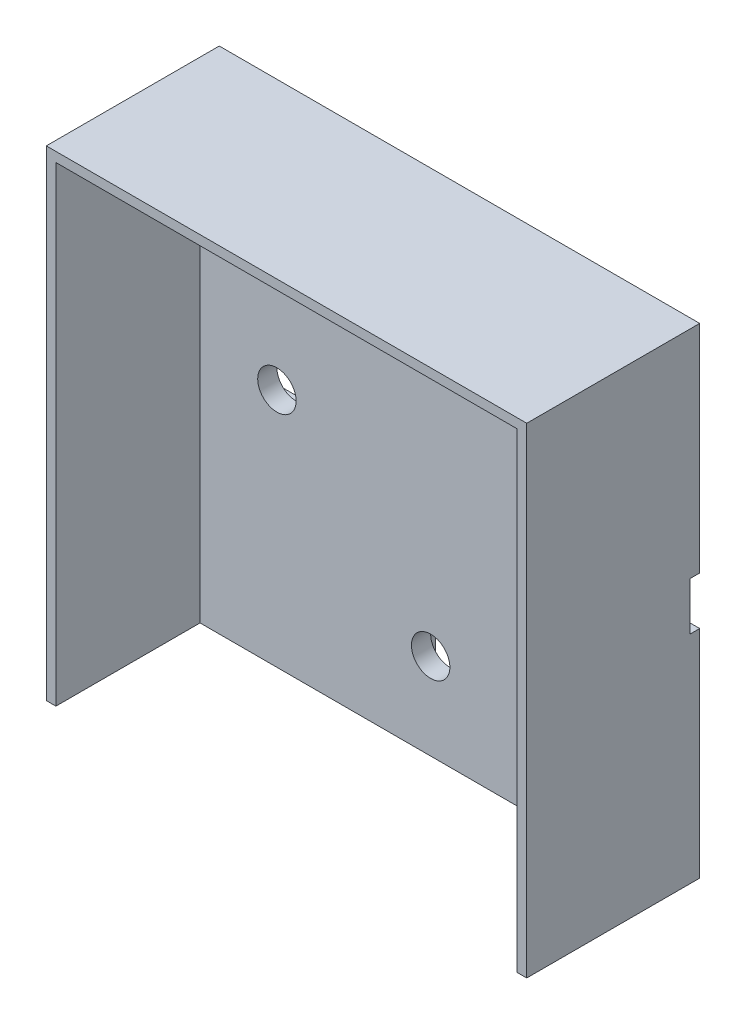
ISO-10303-21;
HEADER;
FILE_DESCRIPTION(('STEP AP214'),'2;1');
FILE_NAME('part.step','',(''),(''),'','','');
FILE_SCHEMA(('AUTOMOTIVE_DESIGN { 1 0 10303 214 1 1 1 1 }'));
ENDSEC;
DATA;
#1=APPLICATION_CONTEXT('core data for automotive mechanical design processes');
#2=APPLICATION_PROTOCOL_DEFINITION('international standard','automotive_design',2000,#1);
#3=PRODUCT_CONTEXT('',#1,'mechanical');
#4=PRODUCT('Part','Part','',(#3));
#5=PRODUCT_RELATED_PRODUCT_CATEGORY('part','',(#4));
#6=PRODUCT_DEFINITION_FORMATION('','',#4);
#7=PRODUCT_DEFINITION_CONTEXT('part definition',#1,'design');
#8=PRODUCT_DEFINITION('design','',#6,#7);
#9=PRODUCT_DEFINITION_SHAPE('','',#8);
#10=(LENGTH_UNIT() NAMED_UNIT(*) SI_UNIT(.MILLI.,.METRE.));
#11=(NAMED_UNIT(*) PLANE_ANGLE_UNIT() SI_UNIT($,.RADIAN.));
#12=(NAMED_UNIT(*) SI_UNIT($,.STERADIAN.) SOLID_ANGLE_UNIT());
#13=UNCERTAINTY_MEASURE_WITH_UNIT(LENGTH_MEASURE(1.E-05),#10,'distance_accuracy_value','');
#14=(GEOMETRIC_REPRESENTATION_CONTEXT(3) GLOBAL_UNCERTAINTY_ASSIGNED_CONTEXT((#13)) GLOBAL_UNIT_ASSIGNED_CONTEXT((#10,
#11,#12)) REPRESENTATION_CONTEXT('',''));
#15=CARTESIAN_POINT('',(0.,0.,0.));
#16=DIRECTION('',(0.,0.,1.));
#17=DIRECTION('',(1.,0.,0.));
#18=AXIS2_PLACEMENT_3D('',#15,#16,#17);
#19=CARTESIAN_POINT('',(0.,0.,3.));
#20=DIRECTION('',(0.,0.,1.));
#21=DIRECTION('',(1.,0.,0.));
#22=AXIS2_PLACEMENT_3D('',#19,#20,#21);
#23=PLANE('',#22);
#24=CARTESIAN_POINT('',(16.,0.,3.));
#25=DIRECTION('',(0.,0.,1.));
#26=DIRECTION('',(1.,0.,0.));
#27=AXIS2_PLACEMENT_3D('',#24,#25,#26);
#28=CIRCLE('',#27,2.);
#29=CARTESIAN_POINT('',(18.,0.,3.));
#30=VERTEX_POINT('',#29);
#31=EDGE_CURVE('E274',#30,#30,#28,.T.);
#32=ORIENTED_EDGE('',*,*,#31,.F.);
#33=EDGE_LOOP('',(#32));
#34=FACE_BOUND('',#33,.T.);
#35=CARTESIAN_POINT('',(-16.,0.,3.));
#36=DIRECTION('',(0.,0.,1.));
#37=DIRECTION('',(1.,0.,0.));
#38=AXIS2_PLACEMENT_3D('',#35,#36,#37);
#39=CIRCLE('',#38,2.);
#40=CARTESIAN_POINT('',(-14.,0.,3.));
#41=VERTEX_POINT('',#40);
#42=EDGE_CURVE('E343',#41,#41,#39,.T.);
#43=ORIENTED_EDGE('',*,*,#42,.F.);
#44=EDGE_LOOP('',(#43));
#45=FACE_BOUND('',#44,.T.);
#46=CARTESIAN_POINT('',(0.,-16.,3.));
#47=DIRECTION('',(0.,0.,1.));
#48=DIRECTION('',(1.,0.,0.));
#49=AXIS2_PLACEMENT_3D('',#46,#47,#48);
#50=CIRCLE('',#49,2.);
#51=CARTESIAN_POINT('',(2.,-16.,3.));
#52=VERTEX_POINT('',#51);
#53=EDGE_CURVE('E346',#52,#52,#50,.T.);
#54=ORIENTED_EDGE('',*,*,#53,.F.);
#55=EDGE_LOOP('',(#54));
#56=FACE_BOUND('',#55,.T.);
#57=DIRECTION('',(1.,0.,0.));
#58=VECTOR('',#57,1.);
#59=CARTESIAN_POINT('',(0.,24.,3.));
#60=LINE('',#59,#58);
#61=CARTESIAN_POINT('',(-24.,24.,3.));
#62=VERTEX_POINT('',#61);
#63=CARTESIAN_POINT('',(24.,24.,3.));
#64=VERTEX_POINT('',#63);
#65=EDGE_CURVE('E52',#62,#64,#60,.T.);
#66=ORIENTED_EDGE('',*,*,#65,.F.);
#67=DIRECTION('',(0.,-1.,0.));
#68=VECTOR('',#67,1.);
#69=CARTESIAN_POINT('',(-24.,0.,3.));
#70=LINE('',#69,#68);
#71=CARTESIAN_POINT('',(-24.,-25.,3.));
#72=VERTEX_POINT('',#71);
#73=EDGE_CURVE('E167',#62,#72,#70,.T.);
#74=ORIENTED_EDGE('',*,*,#73,.T.);
#75=DIRECTION('',(-1.,0.,0.));
#76=VECTOR('',#75,1.);
#77=CARTESIAN_POINT('',(25.,-25.,3.));
#78=LINE('',#77,#76);
#79=CARTESIAN_POINT('',(24.,-25.,3.));
#80=VERTEX_POINT('',#79);
#81=EDGE_CURVE('E227',#80,#72,#78,.T.);
#82=ORIENTED_EDGE('',*,*,#81,.F.);
#83=DIRECTION('',(0.,-1.,0.));
#84=VECTOR('',#83,1.);
#85=CARTESIAN_POINT('',(24.,0.,3.));
#86=LINE('',#85,#84);
#87=EDGE_CURVE('E57',#64,#80,#86,.T.);
#88=ORIENTED_EDGE('',*,*,#87,.F.);
#89=EDGE_LOOP('',(#66,#74,#82,#88));
#90=FACE_BOUND('',#89,.T.);
#91=ADVANCED_FACE('F35',(#34,#45,#56,#90),#23,.T.);
#92=CARTESIAN_POINT('',(25.,25.,3.));
#93=DIRECTION('',(1.,0.,0.));
#94=DIRECTION('',(0.,1.,0.));
#95=AXIS2_PLACEMENT_3D('',#92,#93,#94);
#96=PLANE('',#95);
#97=DIRECTION('',(0.,-1.,0.));
#98=VECTOR('',#97,1.);
#99=CARTESIAN_POINT('',(25.,2.5,1.));
#100=LINE('',#99,#98);
#101=CARTESIAN_POINT('',(25.,2.5,1.));
#102=VERTEX_POINT('',#101);
#103=CARTESIAN_POINT('',(25.,-2.5,1.));
#104=VERTEX_POINT('',#103);
#105=EDGE_CURVE('E179',#102,#104,#100,.T.);
#106=ORIENTED_EDGE('',*,*,#105,.F.);
#107=DIRECTION('',(0.,0.,-1.));
#108=VECTOR('',#107,1.);
#109=CARTESIAN_POINT('',(25.,2.5,1.));
#110=LINE('',#109,#108);
#111=CARTESIAN_POINT('',(25.,2.5,0.));
#112=VERTEX_POINT('',#111);
#113=EDGE_CURVE('E199',#102,#112,#110,.T.);
#114=ORIENTED_EDGE('',*,*,#113,.T.);
#115=DIRECTION('',(0.,-1.,0.));
#116=VECTOR('',#115,1.);
#117=CARTESIAN_POINT('',(25.,25.,0.));
#118=LINE('',#117,#116);
#119=CARTESIAN_POINT('',(25.,25.,0.));
#120=VERTEX_POINT('',#119);
#121=EDGE_CURVE('E230',#120,#112,#118,.T.);
#122=ORIENTED_EDGE('',*,*,#121,.F.);
#123=DIRECTION('',(0.,0.,-1.));
#124=VECTOR('',#123,1.);
#125=CARTESIAN_POINT('',(25.,25.,3.));
#126=LINE('',#125,#124);
#127=CARTESIAN_POINT('',(25.,25.,18.));
#128=VERTEX_POINT('',#127);
#129=EDGE_CURVE('E44',#128,#120,#126,.T.);
#130=ORIENTED_EDGE('',*,*,#129,.F.);
#131=DIRECTION('',(0.,1.,0.));
#132=VECTOR('',#131,1.);
#133=CARTESIAN_POINT('',(25.,0.,18.));
#134=LINE('',#133,#132);
#135=CARTESIAN_POINT('',(25.,-25.,18.));
#136=VERTEX_POINT('',#135);
#137=EDGE_CURVE('E267',#136,#128,#134,.T.);
#138=ORIENTED_EDGE('',*,*,#137,.F.);
#139=DIRECTION('',(0.,0.,-1.));
#140=VECTOR('',#139,1.);
#141=CARTESIAN_POINT('',(25.,-25.,3.));
#142=LINE('',#141,#140);
#143=CARTESIAN_POINT('',(25.,-25.,0.));
#144=VERTEX_POINT('',#143);
#145=EDGE_CURVE('E11',#136,#144,#142,.T.);
#146=ORIENTED_EDGE('',*,*,#145,.T.);
#147=CARTESIAN_POINT('',(25.,-2.5,0.));
#148=VERTEX_POINT('',#147);
#149=EDGE_CURVE('E240',#148,#144,#118,.T.);
#150=ORIENTED_EDGE('',*,*,#149,.F.);
#151=DIRECTION('',(0.,0.,-1.));
#152=VECTOR('',#151,1.);
#153=CARTESIAN_POINT('',(25.,-2.5,1.));
#154=LINE('',#153,#152);
#155=EDGE_CURVE('E192',#104,#148,#154,.T.);
#156=ORIENTED_EDGE('',*,*,#155,.F.);
#157=EDGE_LOOP('',(#106,#114,#122,#130,#138,#146,#150,#156));
#158=FACE_BOUND('',#157,.T.);
#159=ADVANCED_FACE('F282',(#158),#96,.T.);
#160=CARTESIAN_POINT('',(-25.,25.,3.));
#161=DIRECTION('',(1.,0.,0.));
#162=DIRECTION('',(0.,1.,0.));
#163=AXIS2_PLACEMENT_3D('',#160,#161,#162);
#164=PLANE('',#163);
#165=DIRECTION('',(0.,0.,-1.));
#166=VECTOR('',#165,1.);
#167=CARTESIAN_POINT('',(-25.,2.5,1.));
#168=LINE('',#167,#166);
#169=CARTESIAN_POINT('',(-25.,2.5,1.));
#170=VERTEX_POINT('',#169);
#171=CARTESIAN_POINT('',(-25.,2.5,0.));
#172=VERTEX_POINT('',#171);
#173=EDGE_CURVE('E203',#170,#172,#168,.T.);
#174=ORIENTED_EDGE('',*,*,#173,.F.);
#175=DIRECTION('',(0.,-1.,0.));
#176=VECTOR('',#175,1.);
#177=CARTESIAN_POINT('',(-25.,2.5,1.));
#178=LINE('',#177,#176);
#179=CARTESIAN_POINT('',(-25.,-2.5,1.));
#180=VERTEX_POINT('',#179);
#181=EDGE_CURVE('E187',#170,#180,#178,.T.);
#182=ORIENTED_EDGE('',*,*,#181,.T.);
#183=DIRECTION('',(0.,0.,-1.));
#184=VECTOR('',#183,1.);
#185=CARTESIAN_POINT('',(-25.,-2.5,1.));
#186=LINE('',#185,#184);
#187=CARTESIAN_POINT('',(-25.,-2.5,0.));
#188=VERTEX_POINT('',#187);
#189=EDGE_CURVE('E205',#180,#188,#186,.T.);
#190=ORIENTED_EDGE('',*,*,#189,.T.);
#191=DIRECTION('',(0.,-1.,0.));
#192=VECTOR('',#191,1.);
#193=CARTESIAN_POINT('',(-25.,25.,0.));
#194=LINE('',#193,#192);
#195=CARTESIAN_POINT('',(-25.,-25.,0.));
#196=VERTEX_POINT('',#195);
#197=EDGE_CURVE('E234',#188,#196,#194,.T.);
#198=ORIENTED_EDGE('',*,*,#197,.T.);
#199=DIRECTION('',(0.,0.,-1.));
#200=VECTOR('',#199,1.);
#201=CARTESIAN_POINT('',(-25.,-25.,3.));
#202=LINE('',#201,#200);
#203=CARTESIAN_POINT('',(-25.,-25.,18.));
#204=VERTEX_POINT('',#203);
#205=EDGE_CURVE('E39',#204,#196,#202,.T.);
#206=ORIENTED_EDGE('',*,*,#205,.F.);
#207=DIRECTION('',(0.,-1.,0.));
#208=VECTOR('',#207,1.);
#209=CARTESIAN_POINT('',(-25.,0.,18.));
#210=LINE('',#209,#208);
#211=CARTESIAN_POINT('',(-25.,25.,18.));
#212=VERTEX_POINT('',#211);
#213=EDGE_CURVE('E259',#212,#204,#210,.T.);
#214=ORIENTED_EDGE('',*,*,#213,.F.);
#215=DIRECTION('',(0.,0.,-1.));
#216=VECTOR('',#215,1.);
#217=CARTESIAN_POINT('',(-25.,25.,3.));
#218=LINE('',#217,#216);
#219=CARTESIAN_POINT('',(-25.,25.,0.));
#220=VERTEX_POINT('',#219);
#221=EDGE_CURVE('E243',#212,#220,#218,.T.);
#222=ORIENTED_EDGE('',*,*,#221,.T.);
#223=EDGE_CURVE('E235',#220,#172,#194,.T.);
#224=ORIENTED_EDGE('',*,*,#223,.T.);
#225=EDGE_LOOP('',(#174,#182,#190,#198,#206,#214,#222,#224));
#226=FACE_BOUND('',#225,.T.);
#227=ADVANCED_FACE('F258',(#226),#164,.F.);
#228=CARTESIAN_POINT('',(0.,0.,0.));
#229=DIRECTION('',(0.,0.,1.));
#230=DIRECTION('',(1.,0.,0.));
#231=AXIS2_PLACEMENT_3D('',#228,#229,#230);
#232=PLANE('',#231);
#233=DIRECTION('',(-1.,0.,0.));
#234=VECTOR('',#233,1.);
#235=CARTESIAN_POINT('',(25.,2.5,0.));
#236=LINE('',#235,#234);
#237=EDGE_CURVE('E183',#112,#172,#236,.T.);
#238=ORIENTED_EDGE('',*,*,#237,.T.);
#239=ORIENTED_EDGE('',*,*,#223,.F.);
#240=DIRECTION('',(-1.,0.,0.));
#241=VECTOR('',#240,1.);
#242=CARTESIAN_POINT('',(25.,25.,0.));
#243=LINE('',#242,#241);
#244=EDGE_CURVE('E238',#120,#220,#243,.T.);
#245=ORIENTED_EDGE('',*,*,#244,.F.);
#246=ORIENTED_EDGE('',*,*,#121,.T.);
#247=EDGE_LOOP('',(#238,#239,#245,#246));
#248=FACE_BOUND('',#247,.T.);
#249=ADVANCED_FACE('F301',(#248),#232,.F.);
#250=DIRECTION('',(0.,-1.,0.));
#251=VECTOR('',#250,1.);
#252=CARTESIAN_POINT('',(2.5,-2.5,0.));
#253=LINE('',#252,#251);
#254=CARTESIAN_POINT('',(2.5,-2.5,0.));
#255=VERTEX_POINT('',#254);
#256=CARTESIAN_POINT('',(2.5,-25.,0.));
#257=VERTEX_POINT('',#256);
#258=EDGE_CURVE('E173',#255,#257,#253,.T.);
#259=ORIENTED_EDGE('',*,*,#258,.F.);
#260=DIRECTION('',(-1.,0.,0.));
#261=VECTOR('',#260,1.);
#262=CARTESIAN_POINT('',(25.,-2.5,0.));
#263=LINE('',#262,#261);
#264=EDGE_CURVE('E193',#148,#255,#263,.T.);
#265=ORIENTED_EDGE('',*,*,#264,.F.);
#266=ORIENTED_EDGE('',*,*,#149,.T.);
#267=DIRECTION('',(-1.,0.,0.));
#268=VECTOR('',#267,1.);
#269=CARTESIAN_POINT('',(25.,-25.,0.));
#270=LINE('',#269,#268);
#271=EDGE_CURVE('E231',#144,#257,#270,.T.);
#272=ORIENTED_EDGE('',*,*,#271,.T.);
#273=EDGE_LOOP('',(#259,#265,#266,#272));
#274=FACE_BOUND('',#273,.T.);
#275=ADVANCED_FACE('F302',(#274),#232,.F.);
#276=CARTESIAN_POINT('',(25.,-25.,3.));
#277=DIRECTION('',(0.,-1.,0.));
#278=DIRECTION('',(1.,0.,0.));
#279=AXIS2_PLACEMENT_3D('',#276,#277,#278);
#280=PLANE('',#279);
#281=DIRECTION('',(0.,0.,-1.));
#282=VECTOR('',#281,1.);
#283=CARTESIAN_POINT('',(2.5,-25.,1.));
#284=LINE('',#283,#282);
#285=CARTESIAN_POINT('',(2.5,-25.,1.));
#286=VERTEX_POINT('',#285);
#287=EDGE_CURVE('E219',#286,#257,#284,.T.);
#288=ORIENTED_EDGE('',*,*,#287,.T.);
#289=ORIENTED_EDGE('',*,*,#271,.F.);
#290=ORIENTED_EDGE('',*,*,#145,.F.);
#291=DIRECTION('',(1.,0.,0.));
#292=VECTOR('',#291,1.);
#293=CARTESIAN_POINT('',(0.,-25.,18.));
#294=LINE('',#293,#292);
#295=CARTESIAN_POINT('',(24.,-25.,18.));
#296=VERTEX_POINT('',#295);
#297=EDGE_CURVE('E158',#296,#136,#294,.T.);
#298=ORIENTED_EDGE('',*,*,#297,.F.);
#299=DIRECTION('',(0.,0.,-1.));
#300=VECTOR('',#299,1.);
#301=CARTESIAN_POINT('',(24.,-25.,18.));
#302=LINE('',#301,#300);
#303=EDGE_CURVE('E154',#296,#80,#302,.T.);
#304=ORIENTED_EDGE('',*,*,#303,.T.);
#305=ORIENTED_EDGE('',*,*,#81,.T.);
#306=DIRECTION('',(0.,0.,-1.));
#307=VECTOR('',#306,1.);
#308=CARTESIAN_POINT('',(-24.,-25.,18.));
#309=LINE('',#308,#307);
#310=CARTESIAN_POINT('',(-24.,-25.,18.));
#311=VERTEX_POINT('',#310);
#312=EDGE_CURVE('E175',#311,#72,#309,.T.);
#313=ORIENTED_EDGE('',*,*,#312,.F.);
#314=EDGE_CURVE('E255',#204,#311,#294,.T.);
#315=ORIENTED_EDGE('',*,*,#314,.F.);
#316=ORIENTED_EDGE('',*,*,#205,.T.);
#317=CARTESIAN_POINT('',(-2.5,-25.,0.));
#318=VERTEX_POINT('',#317);
#319=EDGE_CURVE('E225',#318,#196,#270,.T.);
#320=ORIENTED_EDGE('',*,*,#319,.F.);
#321=DIRECTION('',(0.,0.,-1.));
#322=VECTOR('',#321,1.);
#323=CARTESIAN_POINT('',(-2.5,-25.,1.));
#324=LINE('',#323,#322);
#325=CARTESIAN_POINT('',(-2.5,-25.,1.));
#326=VERTEX_POINT('',#325);
#327=EDGE_CURVE('E216',#326,#318,#324,.T.);
#328=ORIENTED_EDGE('',*,*,#327,.F.);
#329=DIRECTION('',(-1.,0.,0.));
#330=VECTOR('',#329,1.);
#331=CARTESIAN_POINT('',(2.5,-25.,1.));
#332=LINE('',#331,#330);
#333=EDGE_CURVE('E209',#286,#326,#332,.T.);
#334=ORIENTED_EDGE('',*,*,#333,.F.);
#335=EDGE_LOOP('',(#288,#289,#290,#298,#304,#305,#313,#315,#316,#320,#328,#334));
#336=FACE_BOUND('',#335,.T.);
#337=ADVANCED_FACE('F37',(#336),#280,.T.);
#338=CARTESIAN_POINT('',(25.,25.,3.));
#339=DIRECTION('',(0.,-1.,0.));
#340=DIRECTION('',(1.,0.,0.));
#341=AXIS2_PLACEMENT_3D('',#338,#339,#340);
#342=PLANE('',#341);
#343=ORIENTED_EDGE('',*,*,#244,.T.);
#344=ORIENTED_EDGE('',*,*,#221,.F.);
#345=DIRECTION('',(-1.,0.,0.));
#346=VECTOR('',#345,1.);
#347=CARTESIAN_POINT('',(0.,25.,18.));
#348=LINE('',#347,#346);
#349=EDGE_CURVE('E264',#128,#212,#348,.T.);
#350=ORIENTED_EDGE('',*,*,#349,.F.);
#351=ORIENTED_EDGE('',*,*,#129,.T.);
#352=EDGE_LOOP('',(#343,#344,#350,#351));
#353=FACE_BOUND('',#352,.T.);
#354=ADVANCED_FACE('F299',(#353),#342,.F.);
#355=ORIENTED_EDGE('',*,*,#197,.F.);
#356=CARTESIAN_POINT('',(-2.5,-2.5,0.));
#357=VERTEX_POINT('',#356);
#358=EDGE_CURVE('E196',#357,#188,#263,.T.);
#359=ORIENTED_EDGE('',*,*,#358,.F.);
#360=DIRECTION('',(0.,-1.,0.));
#361=VECTOR('',#360,1.);
#362=CARTESIAN_POINT('',(-2.5,-2.5,0.));
#363=LINE('',#362,#361);
#364=EDGE_CURVE('E170',#357,#318,#363,.T.);
#365=ORIENTED_EDGE('',*,*,#364,.T.);
#366=ORIENTED_EDGE('',*,*,#319,.T.);
#367=EDGE_LOOP('',(#355,#359,#365,#366));
#368=FACE_BOUND('',#367,.T.);
#369=ADVANCED_FACE('F296',(#368),#232,.F.);
#370=CARTESIAN_POINT('',(25.,2.5,1.));
#371=DIRECTION('',(0.,-1.,0.));
#372=DIRECTION('',(0.,0.,-1.));
#373=AXIS2_PLACEMENT_3D('',#370,#371,#372);
#374=PLANE('',#373);
#375=ORIENTED_EDGE('',*,*,#237,.F.);
#376=ORIENTED_EDGE('',*,*,#113,.F.);
#377=DIRECTION('',(-1.,0.,0.));
#378=VECTOR('',#377,1.);
#379=CARTESIAN_POINT('',(25.,2.5,1.));
#380=LINE('',#379,#378);
#381=EDGE_CURVE('E190',#102,#170,#380,.T.);
#382=ORIENTED_EDGE('',*,*,#381,.T.);
#383=ORIENTED_EDGE('',*,*,#173,.T.);
#384=EDGE_LOOP('',(#375,#376,#382,#383));
#385=FACE_BOUND('',#384,.T.);
#386=ADVANCED_FACE('F298',(#385),#374,.T.);
#387=CARTESIAN_POINT('',(0.,0.,1.));
#388=DIRECTION('',(0.,0.,-1.));
#389=DIRECTION('',(-1.,0.,0.));
#390=AXIS2_PLACEMENT_3D('',#387,#388,#389);
#391=PLANE('',#390);
#392=CARTESIAN_POINT('',(16.,0.,1.));
#393=DIRECTION('',(0.,0.,-1.));
#394=DIRECTION('',(-1.,0.,0.));
#395=AXIS2_PLACEMENT_3D('',#392,#393,#394);
#396=CIRCLE('',#395,2.);
#397=CARTESIAN_POINT('',(14.,0.,1.));
#398=VERTEX_POINT('',#397);
#399=EDGE_CURVE('E349',#398,#398,#396,.T.);
#400=ORIENTED_EDGE('',*,*,#399,.F.);
#401=EDGE_LOOP('',(#400));
#402=FACE_BOUND('',#401,.T.);
#403=CARTESIAN_POINT('',(-16.,0.,1.));
#404=DIRECTION('',(0.,0.,-1.));
#405=DIRECTION('',(-1.,0.,0.));
#406=AXIS2_PLACEMENT_3D('',#403,#404,#405);
#407=CIRCLE('',#406,2.);
#408=CARTESIAN_POINT('',(-18.,0.,1.));
#409=VERTEX_POINT('',#408);
#410=EDGE_CURVE('E353',#409,#409,#407,.T.);
#411=ORIENTED_EDGE('',*,*,#410,.F.);
#412=EDGE_LOOP('',(#411));
#413=FACE_BOUND('',#412,.T.);
#414=CARTESIAN_POINT('',(0.,-16.,1.));
#415=DIRECTION('',(0.,0.,-1.));
#416=DIRECTION('',(-1.,0.,0.));
#417=AXIS2_PLACEMENT_3D('',#414,#415,#416);
#418=CIRCLE('',#417,2.);
#419=CARTESIAN_POINT('',(-2.,-16.,1.));
#420=VERTEX_POINT('',#419);
#421=EDGE_CURVE('E350',#420,#420,#418,.T.);
#422=ORIENTED_EDGE('',*,*,#421,.F.);
#423=EDGE_LOOP('',(#422));
#424=FACE_BOUND('',#423,.T.);
#425=ORIENTED_EDGE('',*,*,#105,.T.);
#426=DIRECTION('',(-1.,0.,0.));
#427=VECTOR('',#426,1.);
#428=CARTESIAN_POINT('',(25.,-2.5,1.));
#429=LINE('',#428,#427);
#430=CARTESIAN_POINT('',(2.5,-2.5,1.));
#431=VERTEX_POINT('',#430);
#432=EDGE_CURVE('E184',#104,#431,#429,.T.);
#433=ORIENTED_EDGE('',*,*,#432,.T.);
#434=DIRECTION('',(0.,-1.,0.));
#435=VECTOR('',#434,1.);
#436=CARTESIAN_POINT('',(2.5,-2.5,1.));
#437=LINE('',#436,#435);
#438=EDGE_CURVE('E214',#431,#286,#437,.T.);
#439=ORIENTED_EDGE('',*,*,#438,.T.);
#440=ORIENTED_EDGE('',*,*,#333,.T.);
#441=DIRECTION('',(0.,-1.,0.));
#442=VECTOR('',#441,1.);
#443=CARTESIAN_POINT('',(-2.5,-2.5,1.));
#444=LINE('',#443,#442);
#445=CARTESIAN_POINT('',(-2.5,-2.5,1.));
#446=VERTEX_POINT('',#445);
#447=EDGE_CURVE('E212',#446,#326,#444,.T.);
#448=ORIENTED_EDGE('',*,*,#447,.F.);
#449=EDGE_CURVE('E182',#446,#180,#429,.T.);
#450=ORIENTED_EDGE('',*,*,#449,.T.);
#451=ORIENTED_EDGE('',*,*,#181,.F.);
#452=ORIENTED_EDGE('',*,*,#381,.F.);
#453=EDGE_LOOP('',(#425,#433,#439,#440,#448,#450,#451,#452));
#454=FACE_BOUND('',#453,.T.);
#455=ADVANCED_FACE('F322',(#402,#413,#424,#454),#391,.T.);
#456=CARTESIAN_POINT('',(25.,-2.5,1.));
#457=DIRECTION('',(0.,-1.,0.));
#458=DIRECTION('',(0.,0.,-1.));
#459=AXIS2_PLACEMENT_3D('',#456,#457,#458);
#460=PLANE('',#459);
#461=ORIENTED_EDGE('',*,*,#432,.F.);
#462=ORIENTED_EDGE('',*,*,#155,.T.);
#463=ORIENTED_EDGE('',*,*,#264,.T.);
#464=DIRECTION('',(0.,0.,-1.));
#465=VECTOR('',#464,1.);
#466=CARTESIAN_POINT('',(2.5,-2.5,1.));
#467=LINE('',#466,#465);
#468=EDGE_CURVE('E202',#431,#255,#467,.T.);
#469=ORIENTED_EDGE('',*,*,#468,.F.);
#470=EDGE_LOOP('',(#461,#462,#463,#469));
#471=FACE_BOUND('',#470,.T.);
#472=ADVANCED_FACE('F363',(#471),#460,.F.);
#473=DIRECTION('',(0.,0.,-1.));
#474=VECTOR('',#473,1.);
#475=CARTESIAN_POINT('',(-2.5,-2.5,1.));
#476=LINE('',#475,#474);
#477=EDGE_CURVE('E223',#446,#357,#476,.T.);
#478=ORIENTED_EDGE('',*,*,#477,.T.);
#479=ORIENTED_EDGE('',*,*,#358,.T.);
#480=ORIENTED_EDGE('',*,*,#189,.F.);
#481=ORIENTED_EDGE('',*,*,#449,.F.);
#482=EDGE_LOOP('',(#478,#479,#480,#481));
#483=FACE_BOUND('',#482,.T.);
#484=ADVANCED_FACE('F327',(#483),#460,.F.);
#485=CARTESIAN_POINT('',(2.5,-2.5,1.));
#486=DIRECTION('',(1.,0.,0.));
#487=DIRECTION('',(0.,1.,0.));
#488=AXIS2_PLACEMENT_3D('',#485,#486,#487);
#489=PLANE('',#488);
#490=ORIENTED_EDGE('',*,*,#258,.T.);
#491=ORIENTED_EDGE('',*,*,#287,.F.);
#492=ORIENTED_EDGE('',*,*,#438,.F.);
#493=ORIENTED_EDGE('',*,*,#468,.T.);
#494=EDGE_LOOP('',(#490,#491,#492,#493));
#495=FACE_BOUND('',#494,.T.);
#496=ADVANCED_FACE('F335',(#495),#489,.F.);
#497=CARTESIAN_POINT('',(-2.5,-2.5,1.));
#498=DIRECTION('',(1.,0.,0.));
#499=DIRECTION('',(0.,1.,0.));
#500=AXIS2_PLACEMENT_3D('',#497,#498,#499);
#501=PLANE('',#500);
#502=ORIENTED_EDGE('',*,*,#364,.F.);
#503=ORIENTED_EDGE('',*,*,#477,.F.);
#504=ORIENTED_EDGE('',*,*,#447,.T.);
#505=ORIENTED_EDGE('',*,*,#327,.T.);
#506=EDGE_LOOP('',(#502,#503,#504,#505));
#507=FACE_BOUND('',#506,.T.);
#508=ADVANCED_FACE('F294',(#507),#501,.T.);
#509=CARTESIAN_POINT('',(0.,24.,18.));
#510=DIRECTION('',(0.,1.,0.));
#511=DIRECTION('',(0.,0.,1.));
#512=AXIS2_PLACEMENT_3D('',#509,#510,#511);
#513=PLANE('',#512);
#514=ORIENTED_EDGE('',*,*,#65,.T.);
#515=DIRECTION('',(0.,0.,-1.));
#516=VECTOR('',#515,1.);
#517=CARTESIAN_POINT('',(24.,24.,18.));
#518=LINE('',#517,#516);
#519=CARTESIAN_POINT('',(24.,24.,18.));
#520=VERTEX_POINT('',#519);
#521=EDGE_CURVE('E152',#520,#64,#518,.T.);
#522=ORIENTED_EDGE('',*,*,#521,.F.);
#523=DIRECTION('',(1.,0.,0.));
#524=VECTOR('',#523,1.);
#525=CARTESIAN_POINT('',(0.,24.,18.));
#526=LINE('',#525,#524);
#527=CARTESIAN_POINT('',(-24.,24.,18.));
#528=VERTEX_POINT('',#527);
#529=EDGE_CURVE('E159',#528,#520,#526,.T.);
#530=ORIENTED_EDGE('',*,*,#529,.F.);
#531=DIRECTION('',(0.,0.,-1.));
#532=VECTOR('',#531,1.);
#533=CARTESIAN_POINT('',(-24.,24.,18.));
#534=LINE('',#533,#532);
#535=EDGE_CURVE('E272',#528,#62,#534,.T.);
#536=ORIENTED_EDGE('',*,*,#535,.T.);
#537=EDGE_LOOP('',(#514,#522,#530,#536));
#538=FACE_BOUND('',#537,.T.);
#539=ADVANCED_FACE('F169',(#538),#513,.F.);
#540=CARTESIAN_POINT('',(24.,0.,18.));
#541=DIRECTION('',(1.,0.,0.));
#542=DIRECTION('',(0.,0.,-1.));
#543=AXIS2_PLACEMENT_3D('',#540,#541,#542);
#544=PLANE('',#543);
#545=ORIENTED_EDGE('',*,*,#87,.T.);
#546=ORIENTED_EDGE('',*,*,#303,.F.);
#547=DIRECTION('',(0.,-1.,0.));
#548=VECTOR('',#547,1.);
#549=CARTESIAN_POINT('',(24.,0.,18.));
#550=LINE('',#549,#548);
#551=EDGE_CURVE('E148',#520,#296,#550,.T.);
#552=ORIENTED_EDGE('',*,*,#551,.F.);
#553=ORIENTED_EDGE('',*,*,#521,.T.);
#554=EDGE_LOOP('',(#545,#546,#552,#553));
#555=FACE_BOUND('',#554,.T.);
#556=ADVANCED_FACE('F150',(#555),#544,.F.);
#557=CARTESIAN_POINT('',(-24.,0.,18.));
#558=DIRECTION('',(1.,0.,0.));
#559=DIRECTION('',(0.,1.,0.));
#560=AXIS2_PLACEMENT_3D('',#557,#558,#559);
#561=PLANE('',#560);
#562=ORIENTED_EDGE('',*,*,#73,.F.);
#563=ORIENTED_EDGE('',*,*,#535,.F.);
#564=DIRECTION('',(0.,-1.,0.));
#565=VECTOR('',#564,1.);
#566=CARTESIAN_POINT('',(-24.,0.,18.));
#567=LINE('',#566,#565);
#568=EDGE_CURVE('E165',#528,#311,#567,.T.);
#569=ORIENTED_EDGE('',*,*,#568,.T.);
#570=ORIENTED_EDGE('',*,*,#312,.T.);
#571=EDGE_LOOP('',(#562,#563,#569,#570));
#572=FACE_BOUND('',#571,.T.);
#573=ADVANCED_FACE('F280',(#572),#561,.T.);
#574=CARTESIAN_POINT('',(0.,0.,18.));
#575=DIRECTION('',(0.,0.,1.));
#576=DIRECTION('',(1.,0.,0.));
#577=AXIS2_PLACEMENT_3D('',#574,#575,#576);
#578=PLANE('',#577);
#579=ORIENTED_EDGE('',*,*,#529,.T.);
#580=ORIENTED_EDGE('',*,*,#551,.T.);
#581=ORIENTED_EDGE('',*,*,#297,.T.);
#582=ORIENTED_EDGE('',*,*,#137,.T.);
#583=ORIENTED_EDGE('',*,*,#349,.T.);
#584=ORIENTED_EDGE('',*,*,#213,.T.);
#585=ORIENTED_EDGE('',*,*,#314,.T.);
#586=ORIENTED_EDGE('',*,*,#568,.F.);
#587=EDGE_LOOP('',(#579,#580,#581,#582,#583,#584,#585,#586));
#588=FACE_BOUND('',#587,.T.);
#589=ADVANCED_FACE('F163',(#588),#578,.T.);
#590=CARTESIAN_POINT('',(0.,-16.,5.));
#591=DIRECTION('',(0.,0.,-1.));
#592=DIRECTION('',(-1.,0.,0.));
#593=AXIS2_PLACEMENT_3D('',#590,#591,#592);
#594=CYLINDRICAL_SURFACE('',#593,2.);
#595=ORIENTED_EDGE('',*,*,#53,.T.);
#596=EDGE_LOOP('',(#595));
#597=FACE_BOUND('',#596,.T.);
#598=ORIENTED_EDGE('',*,*,#421,.T.);
#599=EDGE_LOOP('',(#598));
#600=FACE_BOUND('',#599,.T.);
#601=ADVANCED_FACE('F369',(#597,#600),#594,.F.);
#602=CARTESIAN_POINT('',(-16.,0.,5.));
#603=DIRECTION('',(0.,0.,-1.));
#604=DIRECTION('',(-1.,0.,0.));
#605=AXIS2_PLACEMENT_3D('',#602,#603,#604);
#606=CYLINDRICAL_SURFACE('',#605,2.);
#607=ORIENTED_EDGE('',*,*,#42,.T.);
#608=EDGE_LOOP('',(#607));
#609=FACE_BOUND('',#608,.T.);
#610=ORIENTED_EDGE('',*,*,#410,.T.);
#611=EDGE_LOOP('',(#610));
#612=FACE_BOUND('',#611,.T.);
#613=ADVANCED_FACE('F371',(#609,#612),#606,.F.);
#614=CARTESIAN_POINT('',(16.,0.,5.));
#615=DIRECTION('',(0.,0.,-1.));
#616=DIRECTION('',(-1.,0.,0.));
#617=AXIS2_PLACEMENT_3D('',#614,#615,#616);
#618=CYLINDRICAL_SURFACE('',#617,2.);
#619=ORIENTED_EDGE('',*,*,#31,.T.);
#620=EDGE_LOOP('',(#619));
#621=FACE_BOUND('',#620,.T.);
#622=ORIENTED_EDGE('',*,*,#399,.T.);
#623=EDGE_LOOP('',(#622));
#624=FACE_BOUND('',#623,.T.);
#625=ADVANCED_FACE('F359',(#621,#624),#618,.F.);
#626=CLOSED_SHELL('',(#91,#159,#227,#249,#275,#337,#354,#369,#386,#455,#472,#484,#496,#508,#539,
#556,#573,#589,#601,#613,#625));
#627=MANIFOLD_SOLID_BREP('B2',#626);
#628=ADVANCED_BREP_SHAPE_REPRESENTATION('',(#18,#627),#14);
#629=SHAPE_DEFINITION_REPRESENTATION(#9,#628);
ENDSEC;
END-ISO-10303-21;
